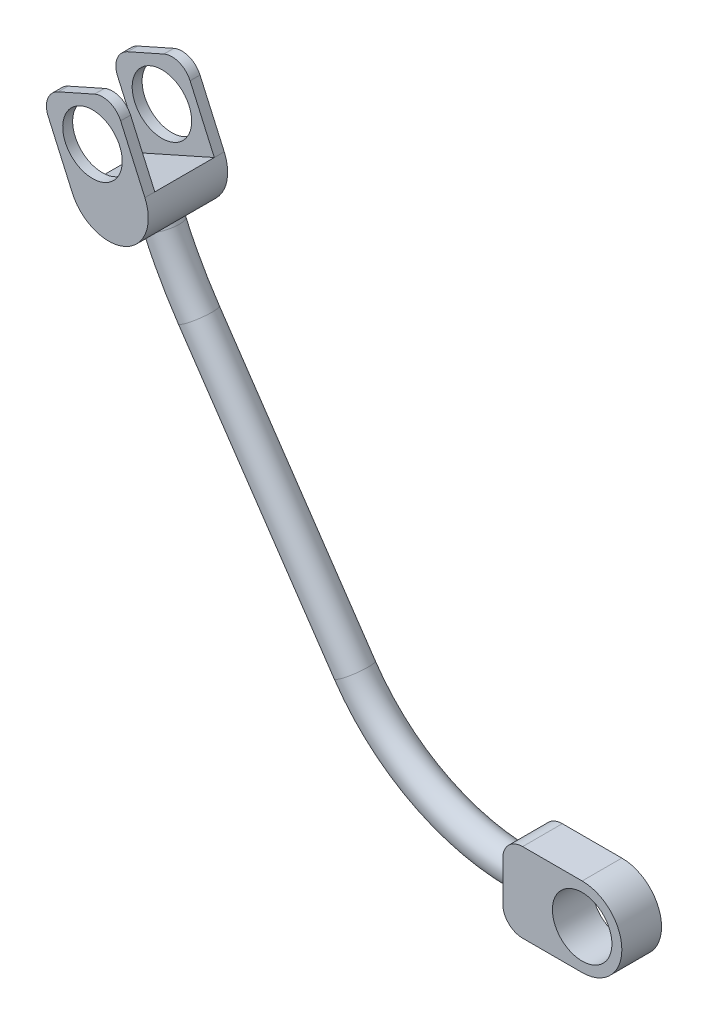
ISO-10303-21;
HEADER;
FILE_DESCRIPTION(('STEP AP214'),'2;1');
FILE_NAME('part.step','',(''),(''),'','','');
FILE_SCHEMA(('AUTOMOTIVE_DESIGN { 1 0 10303 214 1 1 1 1 }'));
ENDSEC;
DATA;
#1=APPLICATION_CONTEXT('core data for automotive mechanical design processes');
#2=APPLICATION_PROTOCOL_DEFINITION('international standard','automotive_design',2000,#1);
#3=PRODUCT_CONTEXT('',#1,'mechanical');
#4=PRODUCT('Part','Part','',(#3));
#5=PRODUCT_RELATED_PRODUCT_CATEGORY('part','',(#4));
#6=PRODUCT_DEFINITION_FORMATION('','',#4);
#7=PRODUCT_DEFINITION_CONTEXT('part definition',#1,'design');
#8=PRODUCT_DEFINITION('design','',#6,#7);
#9=PRODUCT_DEFINITION_SHAPE('','',#8);
#10=(LENGTH_UNIT() NAMED_UNIT(*) SI_UNIT(.MILLI.,.METRE.));
#11=(NAMED_UNIT(*) PLANE_ANGLE_UNIT() SI_UNIT($,.RADIAN.));
#12=(NAMED_UNIT(*) SI_UNIT($,.STERADIAN.) SOLID_ANGLE_UNIT());
#13=UNCERTAINTY_MEASURE_WITH_UNIT(LENGTH_MEASURE(1.E-05),#10,'distance_accuracy_value','');
#14=(GEOMETRIC_REPRESENTATION_CONTEXT(3) GLOBAL_UNCERTAINTY_ASSIGNED_CONTEXT((#13)) GLOBAL_UNIT_ASSIGNED_CONTEXT((#10,
#11,#12)) REPRESENTATION_CONTEXT('',''));
#15=CARTESIAN_POINT('',(0.,0.,0.));
#16=DIRECTION('',(0.,0.,1.));
#17=DIRECTION('',(1.,0.,0.));
#18=AXIS2_PLACEMENT_3D('',#15,#16,#17);
#19=CARTESIAN_POINT('',(-110.264369549458,95.8294636060327,0.));
#20=DIRECTION('',(-0.406736643075799,0.913545457642601,0.));
#21=DIRECTION('',(-0.913545457642601,-0.406736643075799,0.));
#22=AXIS2_PLACEMENT_3D('',#19,#20,#21);
#23=CYLINDRICAL_SURFACE('',#22,4.);
#24=CARTESIAN_POINT('',(-110.264369549459,95.8294636060327,4.00000000000001));
#25=CARTESIAN_POINT('',(-110.362990507074,95.7855370853267,4.00001515276472));
#26=CARTESIAN_POINT('',(-110.462326349155,95.7432409249693,3.99562949503754));
#27=CARTESIAN_POINT('',(-110.661623241283,95.6621358666237,3.97817425046426));
#28=CARTESIAN_POINT('',(-110.761584097444,95.6233259395046,3.9651072359685));
#29=CARTESIAN_POINT('',(-110.961043293078,95.5495203503489,3.93046632499135));
#30=CARTESIAN_POINT('',(-111.060542043311,95.51451206766,3.90892174708062));
#31=CARTESIAN_POINT('',(-111.258623931718,95.4482533171186,3.85756018615502));
#32=CARTESIAN_POINT('',(-111.357207033014,95.4170030000162,3.82774287143961));
#33=CARTESIAN_POINT('',(-111.650310866058,95.3289758228353,3.72631364986528));
#34=CARTESIAN_POINT('',(-111.842508178705,95.2778050578999,3.64266783545964));
#35=CARTESIAN_POINT('',(-112.214750844362,95.1896881131349,3.44607445359489));
#36=CARTESIAN_POINT('',(-112.394787351564,95.1527521978082,3.33310583983869));
#37=CARTESIAN_POINT('',(-112.745043360732,95.0899308532211,3.0755239000453));
#38=CARTESIAN_POINT('',(-112.914522026978,95.0645808934993,2.92977110897774));
#39=CARTESIAN_POINT('',(-113.229718498451,95.0245530373697,2.61318048430075));
#40=CARTESIAN_POINT('',(-113.37542731656,95.0098791702537,2.44233320892421));
#41=CARTESIAN_POINT('',(-113.643899026821,94.9876511924509,2.07114216596097));
#42=CARTESIAN_POINT('',(-113.765349671162,94.9804435820654,1.86982308573622));
#43=CARTESIAN_POINT('',(-113.971132687761,94.970887076529,1.44892280112773));
#44=CARTESIAN_POINT('',(-114.055483419247,94.9685357760552,1.22935069352886));
#45=CARTESIAN_POINT('',(-114.179392429795,94.9658933741943,0.788577585169771));
#46=CARTESIAN_POINT('',(-114.220808737563,94.9655136701321,0.567902129453015));
#47=CARTESIAN_POINT('',(-114.262846210288,94.9651310661673,0.122734664132191));
#48=CARTESIAN_POINT('',(-114.263486592234,94.9651279887664,-0.101755497768421));
#49=CARTESIAN_POINT('',(-114.225377577113,94.965470289453,-0.531515088909115));
#50=CARTESIAN_POINT('',(-114.18936646081,94.9657914312364,-0.73703485948258));
#51=CARTESIAN_POINT('',(-114.084039696666,94.9678490789758,-1.13932254211926));
#52=CARTESIAN_POINT('',(-114.014718803355,94.9695858078818,-1.33608907042836));
#53=CARTESIAN_POINT('',(-113.844303806859,94.9764355447928,-1.7200344571636));
#54=CARTESIAN_POINT('',(-113.742590020484,94.9816167470509,-1.90693562267497));
#55=CARTESIAN_POINT('',(-113.511924070962,94.9979104046763,-2.26283106455256));
#56=CARTESIAN_POINT('',(-113.382961417982,95.0090251467652,-2.43181840701162));
#57=CARTESIAN_POINT('',(-113.091181247359,95.0409984793942,-2.76080536784583));
#58=CARTESIAN_POINT('',(-112.92651823878,95.0625433363924,-2.91910275754984));
#59=CARTESIAN_POINT('',(-112.575721125301,95.1187080553387,-3.20737031862568));
#60=CARTESIAN_POINT('',(-112.389580289149,95.1533320241148,-3.33733157224235));
#61=CARTESIAN_POINT('',(-112.096940322955,95.2173027296596,-3.50925088073896));
#62=CARTESIAN_POINT('',(-111.996035262399,95.2409427102309,-3.563155079602));
#63=CARTESIAN_POINT('',(-111.79104648353,95.2924811385045,-3.66212741897967));
#64=CARTESIAN_POINT('',(-111.686964143176,95.3203777605498,-3.70719932878738));
#65=CARTESIAN_POINT('',(-111.476609340095,95.3805450430087,-3.7880317418878));
#66=CARTESIAN_POINT('',(-111.370339283719,95.4128110947019,-3.82380194174061));
#67=CARTESIAN_POINT('',(-111.15648007709,95.4817555093814,-3.8857063927814));
#68=CARTESIAN_POINT('',(-111.048891504985,95.5184319965419,-3.91184472146079));
#69=CARTESIAN_POINT('',(-110.827938816309,95.5980706982698,-3.95525412759441));
#70=CARTESIAN_POINT('',(-110.714554481982,95.6412552909181,-3.97201744730844));
#71=CARTESIAN_POINT('',(-110.488595686435,95.7320835997381,-3.99439885801446));
#72=CARTESIAN_POINT('',(-110.3760205897,95.7797232791726,-4.00002693807276));
#73=CARTESIAN_POINT('',(-110.264369549459,95.8294636060327,-4.00000000000001));
#74=B_SPLINE_CURVE_WITH_KNOTS('',3,(#24,#25,#26,#27,#28,#29,#30,#31,#32,#33,#34,#35,#36,#37,#38,
#39,#40,#41,#42,#43,#44,#45,#46,#47,#48,#49,#50,#51,#52,#53,#54,#55,#56,#57,#58,#59,#60,#61,#62,
#63,#64,#65,#66,#67,#68,#69,#70,#71,#72,#73),.UNSPECIFIED.,.F.,.F.,(4,2,2,2,2,2,2,2,2,2,2,2,2,2,
2,2,2,2,2,2,2,2,2,2,4),(0.,0.323763399439455,0.64743090814508,0.969988755625815,
1.29255953813415,1.9366716669481,2.58124738867306,3.25317707069423,3.92536021607208,
4.627504425915,5.32930078132312,5.9992674862789,6.66891844518891,7.29196418070528,
7.9151080627593,8.55097179373859,9.18708075677842,9.87231979251034,10.5577741717068,
10.9078494779203,11.2577750580611,11.6073343828352,11.9567455570558,12.3235983530122,
12.690121907611),.UNSPECIFIED.);
#75=CARTESIAN_POINT('',(-110.264369549459,95.8294636060326,4.));
#76=VERTEX_POINT('',#75);
#77=CARTESIAN_POINT('',(-110.264369549459,95.8294636060327,-4.00000000000001));
#78=VERTEX_POINT('',#77);
#79=EDGE_CURVE('E294',#76,#78,#74,.T.);
#80=ORIENTED_EDGE('',*,*,#79,.T.);
#81=CARTESIAN_POINT('',(-110.264369549458,95.8294636060327,0.));
#82=DIRECTION('',(-0.4067366430758,0.913545457642601,0.));
#83=DIRECTION('',(0.,0.,1.));
#84=AXIS2_PLACEMENT_3D('',#81,#82,#83);
#85=CIRCLE('',#84,4.);
#86=EDGE_CURVE('E453',#78,#76,#85,.T.);
#87=ORIENTED_EDGE('',*,*,#86,.T.);
#88=EDGE_LOOP('',(#80,#87));
#89=FACE_BOUND('',#88,.T.);
#90=ADVANCED_FACE('F36',(#89),#23,.T.);
#91=CARTESIAN_POINT('',(0.,0.,5.));
#92=DIRECTION('',(0.,0.,-1.));
#93=DIRECTION('',(-1.,0.,0.));
#94=AXIS2_PLACEMENT_3D('',#91,#92,#93);
#95=CYLINDRICAL_SURFACE('',#94,10.);
#96=DIRECTION('',(0.,0.,-1.));
#97=VECTOR('',#96,1.);
#98=CARTESIAN_POINT('',(0.,10.,5.));
#99=LINE('',#98,#97);
#100=CARTESIAN_POINT('',(0.,10.,5.));
#101=VERTEX_POINT('',#100);
#102=CARTESIAN_POINT('',(0.,10.,-5.));
#103=VERTEX_POINT('',#102);
#104=EDGE_CURVE('E426',#101,#103,#99,.T.);
#105=ORIENTED_EDGE('',*,*,#104,.F.);
#106=CARTESIAN_POINT('',(0.,0.,5.));
#107=DIRECTION('',(0.,0.,-1.));
#108=DIRECTION('',(-1.,0.,0.));
#109=AXIS2_PLACEMENT_3D('',#106,#107,#108);
#110=CIRCLE('',#109,10.);
#111=CARTESIAN_POINT('',(0.,-10.,5.));
#112=VERTEX_POINT('',#111);
#113=EDGE_CURVE('E421',#112,#101,#110,.F.);
#114=ORIENTED_EDGE('',*,*,#113,.F.);
#115=DIRECTION('',(0.,0.,-1.));
#116=VECTOR('',#115,1.);
#117=CARTESIAN_POINT('',(0.,-10.,5.));
#118=LINE('',#117,#116);
#119=CARTESIAN_POINT('',(0.,-10.,-5.));
#120=VERTEX_POINT('',#119);
#121=EDGE_CURVE('E423',#120,#112,#118,.F.);
#122=ORIENTED_EDGE('',*,*,#121,.F.);
#123=CARTESIAN_POINT('',(0.,0.,-5.));
#124=DIRECTION('',(0.,0.,-1.));
#125=DIRECTION('',(-1.,0.,0.));
#126=AXIS2_PLACEMENT_3D('',#123,#124,#125);
#127=CIRCLE('',#126,10.);
#128=EDGE_CURVE('E418',#103,#120,#127,.T.);
#129=ORIENTED_EDGE('',*,*,#128,.F.);
#130=EDGE_LOOP('',(#105,#114,#122,#129));
#131=FACE_BOUND('',#130,.T.);
#132=ADVANCED_FACE('F371',(#131),#95,.T.);
#133=CARTESIAN_POINT('',(-20.,10.,5.));
#134=DIRECTION('',(0.,-1.,0.));
#135=DIRECTION('',(0.,0.,-1.));
#136=AXIS2_PLACEMENT_3D('',#133,#134,#135);
#137=PLANE('',#136);
#138=DIRECTION('',(-1.,0.,0.));
#139=VECTOR('',#138,1.);
#140=CARTESIAN_POINT('',(-20.,10.,-5.));
#141=LINE('',#140,#139);
#142=CARTESIAN_POINT('',(-15.,10.,-5.));
#143=VERTEX_POINT('',#142);
#144=EDGE_CURVE('E436',#103,#143,#141,.T.);
#145=ORIENTED_EDGE('',*,*,#144,.T.);
#146=DIRECTION('',(0.,0.,-1.));
#147=VECTOR('',#146,1.);
#148=CARTESIAN_POINT('',(-15.,10.,5.));
#149=LINE('',#148,#147);
#150=CARTESIAN_POINT('',(-15.,10.,5.));
#151=VERTEX_POINT('',#150);
#152=EDGE_CURVE('E11',#143,#151,#149,.F.);
#153=ORIENTED_EDGE('',*,*,#152,.T.);
#154=DIRECTION('',(-1.,0.,0.));
#155=VECTOR('',#154,1.);
#156=CARTESIAN_POINT('',(-20.,10.,5.));
#157=LINE('',#156,#155);
#158=EDGE_CURVE('E432',#101,#151,#157,.T.);
#159=ORIENTED_EDGE('',*,*,#158,.F.);
#160=ORIENTED_EDGE('',*,*,#104,.T.);
#161=EDGE_LOOP('',(#145,#153,#159,#160));
#162=FACE_BOUND('',#161,.T.);
#163=ADVANCED_FACE('F378',(#162),#137,.F.);
#164=CARTESIAN_POINT('',(-20.,-10.,5.));
#165=DIRECTION('',(1.,0.,0.));
#166=DIRECTION('',(0.,0.,-1.));
#167=AXIS2_PLACEMENT_3D('',#164,#165,#166);
#168=PLANE('',#167);
#169=CARTESIAN_POINT('',(-20.,0.,0.));
#170=DIRECTION('',(-1.,0.,0.));
#171=DIRECTION('',(0.,0.,1.));
#172=AXIS2_PLACEMENT_3D('',#169,#170,#171);
#173=CIRCLE('',#172,4.);
#174=CARTESIAN_POINT('',(-20.,-4.,0.));
#175=VERTEX_POINT('',#174);
#176=EDGE_CURVE('E446',#175,#175,#173,.T.);
#177=ORIENTED_EDGE('',*,*,#176,.F.);
#178=EDGE_LOOP('',(#177));
#179=FACE_BOUND('',#178,.T.);
#180=DIRECTION('',(0.,-1.,0.));
#181=VECTOR('',#180,1.);
#182=CARTESIAN_POINT('',(-20.,-10.,-5.));
#183=LINE('',#182,#181);
#184=CARTESIAN_POINT('',(-20.,5.,-5.));
#185=VERTEX_POINT('',#184);
#186=CARTESIAN_POINT('',(-20.,-5.,-5.));
#187=VERTEX_POINT('',#186);
#188=EDGE_CURVE('E433',#185,#187,#183,.T.);
#189=ORIENTED_EDGE('',*,*,#188,.T.);
#190=DIRECTION('',(0.,0.,-1.));
#191=VECTOR('',#190,1.);
#192=CARTESIAN_POINT('',(-20.,-5.,5.));
#193=LINE('',#192,#191);
#194=CARTESIAN_POINT('',(-20.,-5.,5.));
#195=VERTEX_POINT('',#194);
#196=EDGE_CURVE('E406',#187,#195,#193,.F.);
#197=ORIENTED_EDGE('',*,*,#196,.T.);
#198=DIRECTION('',(0.,-1.,0.));
#199=VECTOR('',#198,1.);
#200=CARTESIAN_POINT('',(-20.,-10.,5.));
#201=LINE('',#200,#199);
#202=CARTESIAN_POINT('',(-20.,5.,5.));
#203=VERTEX_POINT('',#202);
#204=EDGE_CURVE('E440',#203,#195,#201,.T.);
#205=ORIENTED_EDGE('',*,*,#204,.F.);
#206=DIRECTION('',(0.,0.,-1.));
#207=VECTOR('',#206,1.);
#208=CARTESIAN_POINT('',(-20.,5.,5.));
#209=LINE('',#208,#207);
#210=EDGE_CURVE('E402',#203,#185,#209,.T.);
#211=ORIENTED_EDGE('',*,*,#210,.T.);
#212=EDGE_LOOP('',(#189,#197,#205,#211));
#213=FACE_BOUND('',#212,.T.);
#214=ADVANCED_FACE('F531',(#179,#213),#168,.F.);
#215=CARTESIAN_POINT('',(-20.,-10.,5.));
#216=DIRECTION('',(0.,1.,0.));
#217=DIRECTION('',(0.,0.,1.));
#218=AXIS2_PLACEMENT_3D('',#215,#216,#217);
#219=PLANE('',#218);
#220=DIRECTION('',(1.,0.,0.));
#221=VECTOR('',#220,1.);
#222=CARTESIAN_POINT('',(-20.,-10.,5.));
#223=LINE('',#222,#221);
#224=CARTESIAN_POINT('',(-15.,-10.,5.));
#225=VERTEX_POINT('',#224);
#226=EDGE_CURVE('E429',#225,#112,#223,.T.);
#227=ORIENTED_EDGE('',*,*,#226,.F.);
#228=DIRECTION('',(0.,0.,-1.));
#229=VECTOR('',#228,1.);
#230=CARTESIAN_POINT('',(-15.,-10.,5.));
#231=LINE('',#230,#229);
#232=CARTESIAN_POINT('',(-15.,-10.,-5.));
#233=VERTEX_POINT('',#232);
#234=EDGE_CURVE('E415',#225,#233,#231,.T.);
#235=ORIENTED_EDGE('',*,*,#234,.T.);
#236=DIRECTION('',(1.,0.,0.));
#237=VECTOR('',#236,1.);
#238=CARTESIAN_POINT('',(-20.,-10.,-5.));
#239=LINE('',#238,#237);
#240=EDGE_CURVE('E430',#233,#120,#239,.T.);
#241=ORIENTED_EDGE('',*,*,#240,.T.);
#242=ORIENTED_EDGE('',*,*,#121,.T.);
#243=EDGE_LOOP('',(#227,#235,#241,#242));
#244=FACE_BOUND('',#243,.T.);
#245=ADVANCED_FACE('F534',(#244),#219,.F.);
#246=CARTESIAN_POINT('',(0.,0.,5.));
#247=DIRECTION('',(0.,0.,-1.));
#248=DIRECTION('',(-1.,0.,0.));
#249=AXIS2_PLACEMENT_3D('',#246,#247,#248);
#250=PLANE('',#249);
#251=CARTESIAN_POINT('',(0.,0.,5.));
#252=DIRECTION('',(0.,0.,1.));
#253=DIRECTION('',(1.,0.,0.));
#254=AXIS2_PLACEMENT_3D('',#251,#252,#253);
#255=CIRCLE('',#254,7.5);
#256=CARTESIAN_POINT('',(7.5,0.,5.));
#257=VERTEX_POINT('',#256);
#258=EDGE_CURVE('E443',#257,#257,#255,.T.);
#259=ORIENTED_EDGE('',*,*,#258,.F.);
#260=EDGE_LOOP('',(#259));
#261=FACE_BOUND('',#260,.T.);
#262=ORIENTED_EDGE('',*,*,#204,.T.);
#263=CARTESIAN_POINT('',(-15.,-5.,5.));
#264=DIRECTION('',(0.,0.,-1.));
#265=DIRECTION('',(-1.,0.,0.));
#266=AXIS2_PLACEMENT_3D('',#263,#264,#265);
#267=CIRCLE('',#266,5.);
#268=EDGE_CURVE('E44',#195,#225,#267,.F.);
#269=ORIENTED_EDGE('',*,*,#268,.T.);
#270=ORIENTED_EDGE('',*,*,#226,.T.);
#271=ORIENTED_EDGE('',*,*,#113,.T.);
#272=ORIENTED_EDGE('',*,*,#158,.T.);
#273=CARTESIAN_POINT('',(-15.,5.,5.));
#274=DIRECTION('',(0.,0.,-1.));
#275=DIRECTION('',(-1.,0.,0.));
#276=AXIS2_PLACEMENT_3D('',#273,#274,#275);
#277=CIRCLE('',#276,5.);
#278=EDGE_CURVE('E400',#151,#203,#277,.F.);
#279=ORIENTED_EDGE('',*,*,#278,.T.);
#280=EDGE_LOOP('',(#262,#269,#270,#271,#272,#279));
#281=FACE_BOUND('',#280,.T.);
#282=ADVANCED_FACE('F542',(#261,#281),#250,.F.);
#283=CARTESIAN_POINT('',(0.,0.,-5.));
#284=DIRECTION('',(0.,0.,-1.));
#285=DIRECTION('',(-1.,0.,0.));
#286=AXIS2_PLACEMENT_3D('',#283,#284,#285);
#287=PLANE('',#286);
#288=CARTESIAN_POINT('',(0.,0.,-5.));
#289=DIRECTION('',(0.,0.,1.));
#290=DIRECTION('',(1.,0.,0.));
#291=AXIS2_PLACEMENT_3D('',#288,#289,#290);
#292=CIRCLE('',#291,7.5);
#293=CARTESIAN_POINT('',(7.5,0.,-5.));
#294=VERTEX_POINT('',#293);
#295=EDGE_CURVE('E438',#294,#294,#292,.T.);
#296=ORIENTED_EDGE('',*,*,#295,.T.);
#297=EDGE_LOOP('',(#296));
#298=FACE_BOUND('',#297,.T.);
#299=ORIENTED_EDGE('',*,*,#240,.F.);
#300=CARTESIAN_POINT('',(-15.,-5.,-5.));
#301=DIRECTION('',(0.,0.,-1.));
#302=DIRECTION('',(-1.,0.,0.));
#303=AXIS2_PLACEMENT_3D('',#300,#301,#302);
#304=CIRCLE('',#303,5.);
#305=EDGE_CURVE('E411',#233,#187,#304,.T.);
#306=ORIENTED_EDGE('',*,*,#305,.T.);
#307=ORIENTED_EDGE('',*,*,#188,.F.);
#308=CARTESIAN_POINT('',(-15.,5.,-5.));
#309=DIRECTION('',(0.,0.,-1.));
#310=DIRECTION('',(-1.,0.,0.));
#311=AXIS2_PLACEMENT_3D('',#308,#309,#310);
#312=CIRCLE('',#311,5.);
#313=EDGE_CURVE('E413',#185,#143,#312,.T.);
#314=ORIENTED_EDGE('',*,*,#313,.T.);
#315=ORIENTED_EDGE('',*,*,#144,.F.);
#316=ORIENTED_EDGE('',*,*,#128,.T.);
#317=EDGE_LOOP('',(#299,#306,#307,#314,#315,#316));
#318=FACE_BOUND('',#317,.T.);
#319=ADVANCED_FACE('F549',(#298,#318),#287,.T.);
#320=CARTESIAN_POINT('',(0.,0.,-5.));
#321=DIRECTION('',(0.,0.,1.));
#322=DIRECTION('',(1.,0.,0.));
#323=AXIS2_PLACEMENT_3D('',#320,#321,#322);
#324=CYLINDRICAL_SURFACE('',#323,7.5);
#325=ORIENTED_EDGE('',*,*,#295,.F.);
#326=EDGE_LOOP('',(#325));
#327=FACE_BOUND('',#326,.T.);
#328=ORIENTED_EDGE('',*,*,#258,.T.);
#329=EDGE_LOOP('',(#328));
#330=FACE_BOUND('',#329,.T.);
#331=ADVANCED_FACE('F396',(#327,#330),#324,.F.);
#332=CARTESIAN_POINT('',(-15.,-5.,5.));
#333=DIRECTION('',(0.,0.,-1.));
#334=DIRECTION('',(-1.,0.,0.));
#335=AXIS2_PLACEMENT_3D('',#332,#333,#334);
#336=CYLINDRICAL_SURFACE('',#335,5.);
#337=ORIENTED_EDGE('',*,*,#268,.F.);
#338=ORIENTED_EDGE('',*,*,#196,.F.);
#339=ORIENTED_EDGE('',*,*,#305,.F.);
#340=ORIENTED_EDGE('',*,*,#234,.F.);
#341=EDGE_LOOP('',(#337,#338,#339,#340));
#342=FACE_BOUND('',#341,.T.);
#343=ADVANCED_FACE('F391',(#342),#336,.T.);
#344=CARTESIAN_POINT('',(-15.,5.,5.));
#345=DIRECTION('',(0.,0.,-1.));
#346=DIRECTION('',(-1.,0.,0.));
#347=AXIS2_PLACEMENT_3D('',#344,#345,#346);
#348=CYLINDRICAL_SURFACE('',#347,5.);
#349=ORIENTED_EDGE('',*,*,#278,.F.);
#350=ORIENTED_EDGE('',*,*,#152,.F.);
#351=ORIENTED_EDGE('',*,*,#313,.F.);
#352=ORIENTED_EDGE('',*,*,#210,.F.);
#353=EDGE_LOOP('',(#349,#350,#351,#352));
#354=FACE_BOUND('',#353,.T.);
#355=ADVANCED_FACE('F38',(#354),#348,.T.);
#356=CARTESIAN_POINT('',(-110.264369549459,95.8294636060327,-4.00000000000001));
#357=CARTESIAN_POINT('',(-110.165735481726,95.873360680933,-4.00001515276472));
#358=CARTESIAN_POINT('',(-110.067834656773,95.9188799425336,-3.99562949503754));
#359=CARTESIAN_POINT('',(-109.874206202069,96.0127165197823,-3.97817425046426));
#360=CARTESIAN_POINT('',(-109.778477937258,96.0610330027228,-3.9651072359685));
#361=CARTESIAN_POINT('',(-109.590165443067,96.1598744932278,-3.93046632499135));
#362=CARTESIAN_POINT('',(-109.497571559863,96.2103913611817,-3.90892174708062));
#363=CARTESIAN_POINT('',(-109.315789058157,96.3132591336454,-3.85756018615502));
#364=CARTESIAN_POINT('',(-109.226600576361,96.3656101116215,-3.8277428714396));
#365=CARTESIAN_POINT('',(-108.965058889607,96.5245270300328,-3.72631364986528));
#366=CARTESIAN_POINT('',(-108.798426496077,96.6331175434282,-3.64266783545965));
#367=CARTESIAN_POINT('',(-108.483863883955,96.8507860095519,-3.4460744535949));
#368=CARTESIAN_POINT('',(-108.335947212375,96.9598642568568,-3.33310583983869));
#369=CARTESIAN_POINT('',(-108.05489483942,97.1781195132667,-3.0755239000453));
#370=CARTESIAN_POINT('',(-107.922652785316,97.2871042731964,-2.92977110897774));
#371=CARTESIAN_POINT('',(-107.68199868508,97.4945570363372,-2.61318048430075));
#372=CARTESIAN_POINT('',(-107.57359564685,97.5930210569402,-2.44233320892422));
#373=CARTESIAN_POINT('',(-107.377434401887,97.7776609989427,-2.07114216596097));
#374=CARTESIAN_POINT('',(-107.290811760235,97.8630935841277,-1.86982308573622));
#375=CARTESIAN_POINT('',(-107.146014177921,98.0096256177399,-1.44892280112773));
#376=CARTESIAN_POINT('',(-107.087825165035,98.0707371002572,-1.22935069352887));
#377=CARTESIAN_POINT('',(-107.002950166403,98.1610513283169,-0.788577585169777));
#378=CARTESIAN_POINT('',(-106.974955072164,98.1915755715154,-0.567902129453021));
#379=CARTESIAN_POINT('',(-106.946542182393,98.2225594898245,-0.122734664132199));
#380=CARTESIAN_POINT('',(-106.946111396279,98.2230333271706,0.101755497768412));
#381=CARTESIAN_POINT('',(-106.971865683658,98.1949418536457,0.531515088909104));
#382=CARTESIAN_POINT('',(-106.9962004786,98.1683952647019,0.737034859482571));
#383=CARTESIAN_POINT('',(-107.068206970428,98.0914990600234,1.13932254211925));
#384=CARTESIAN_POINT('',(-107.115882342903,98.0411456953277,1.33608907042836));
#385=CARTESIAN_POINT('',(-107.235002579382,97.9190860411104,1.7200344571636));
#386=CARTESIAN_POINT('',(-107.306912770582,97.8469648680952,1.90693562267496));
#387=CARTESIAN_POINT('',(-107.473366964604,97.6864492463002,2.26283106455254));
#388=CARTESIAN_POINT('',(-107.56791968586,97.598048532172,2.43181840701161));
#389=CARTESIAN_POINT('',(-107.786919545049,97.4026079436462,2.76080536784583));
#390=CARTESIAN_POINT('',(-107.913111552818,97.2946558041003,2.91910275754984));
#391=CARTESIAN_POINT('',(-108.189579158329,97.0715442768705,3.20737031862568));
#392=CARTESIAN_POINT('',(-108.339862312125,96.9563826348956,3.33733157224236));
#393=CARTESIAN_POINT('',(-108.583216168957,96.7817135152812,3.50925088073896));
#394=CARTESIAN_POINT('',(-108.668302762547,96.7225446761987,3.563155079602));
#395=CARTESIAN_POINT('',(-108.843767544733,96.6046942656624,3.66212741897966));
#396=CARTESIAN_POINT('',(-108.934143454567,96.5460124966293,3.70719932878737));
#397=CARTESIAN_POINT('',(-109.119611296125,96.4299481834001,3.7880317418878));
#398=CARTESIAN_POINT('',(-109.214698192741,96.3725643436354,3.82380194174061));
#399=CARTESIAN_POINT('',(-109.409033618362,96.2597687988479,3.8857063927814));
#400=CARTESIAN_POINT('',(-109.508280366502,96.2043562683005,3.9118447214608));
#401=CARTESIAN_POINT('',(-109.71530966215,96.0934451138119,3.95525412759441));
#402=CARTESIAN_POINT('',(-109.823270997097,96.0380802651306,3.97201744730844));
#403=CARTESIAN_POINT('',(-110.041965530679,95.9309361568042,3.99439885801445));
#404=CARTESIAN_POINT('',(-110.152696154677,95.8791537237753,4.00002693807276));
#405=CARTESIAN_POINT('',(-110.264369549459,95.8294636060327,4.00000000000001));
#406=B_SPLINE_CURVE_WITH_KNOTS('',3,(#356,#357,#358,#359,#360,#361,#362,#363,#364,#365,#366,
#367,#368,#369,#370,#371,#372,#373,#374,#375,#376,#377,#378,#379,#380,#381,#382,#383,#384,#385,
#386,#387,#388,#389,#390,#391,#392,#393,#394,#395,#396,#397,#398,#399,#400,#401,#402,#403,#404,
#405),.UNSPECIFIED.,.F.,.F.,(4,2,2,2,2,2,2,2,2,2,2,2,2,2,2,2,2,2,2,2,2,2,2,2,4),(0.,
0.323763399439447,0.647430908145065,0.96998875562579,1.29255953813412,1.93667166694806,
2.58124738867303,3.25317707069421,3.92536021607205,4.62750442591497,5.32930078132309,
5.99926748627886,6.66891844518887,7.29196418070525,7.91510806275927,8.55097179373855,
9.18708075677839,9.87231979251031,10.5577741717067,10.9078494779202,11.257775058061,
11.6073343828351,11.9567455570557,12.3235983530121,12.690121907611),.UNSPECIFIED.);
#407=EDGE_CURVE('E50',#78,#76,#406,.T.);
#408=ORIENTED_EDGE('',*,*,#407,.T.);
#409=EDGE_CURVE('E451',#76,#78,#85,.T.);
#410=ORIENTED_EDGE('',*,*,#409,.T.);
#411=EDGE_LOOP('',(#408,#410));
#412=FACE_BOUND('',#411,.T.);
#413=ADVANCED_FACE('F374',(#412),#23,.T.);
#414=CARTESIAN_POINT('',(-18.4680858332064,136.699802321229,0.));
#415=DIRECTION('',(0.,0.,-1.));
#416=DIRECTION('',(-1.,0.,0.));
#417=AXIS2_PLACEMENT_3D('',#414,#415,#416);
#418=TOROIDAL_SURFACE('',#417,100.483542387843,4.);
#419=CARTESIAN_POINT('',(-101.587122571258,80.2359375708601,0.));
#420=DIRECTION('',(-0.561921518774003,0.8271905504409,0.));
#421=DIRECTION('',(0.,0.,1.));
#422=AXIS2_PLACEMENT_3D('',#419,#420,#421);
#423=CIRCLE('',#422,4.);
#424=CARTESIAN_POINT('',(-101.587122571258,80.2359375708601,4.));
#425=VERTEX_POINT('',#424);
#426=EDGE_CURVE('E454',#425,#425,#423,.T.);
#427=ORIENTED_EDGE('',*,*,#426,.T.);
#428=EDGE_LOOP('',(#427));
#429=FACE_BOUND('',#428,.T.);
#430=ORIENTED_EDGE('',*,*,#409,.F.);
#431=ORIENTED_EDGE('',*,*,#86,.F.);
#432=EDGE_LOOP('',(#430,#431));
#433=FACE_BOUND('',#432,.T.);
#434=ADVANCED_FACE('F384',(#429,#433),#418,.T.);
#435=CARTESIAN_POINT('',(-62.2996233011042,22.4017969285343,0.));
#436=DIRECTION('',(-0.561921518774002,0.8271905504409,0.));
#437=DIRECTION('',(-0.8271905504409,-0.561921518774002,0.));
#438=AXIS2_PLACEMENT_3D('',#435,#436,#437);
#439=CYLINDRICAL_SURFACE('',#438,4.);
#440=CARTESIAN_POINT('',(-62.2996233011042,22.4017969285343,0.));
#441=DIRECTION('',(-0.561921518774003,0.8271905504409,0.));
#442=DIRECTION('',(0.,0.,1.));
#443=AXIS2_PLACEMENT_3D('',#440,#441,#442);
#444=CIRCLE('',#443,4.);
#445=CARTESIAN_POINT('',(-65.6083855028678,20.1541108534383,0.));
#446=VERTEX_POINT('',#445);
#447=EDGE_CURVE('E457',#446,#446,#444,.T.);
#448=ORIENTED_EDGE('',*,*,#447,.T.);
#449=EDGE_LOOP('',(#448));
#450=FACE_BOUND('',#449,.T.);
#451=ORIENTED_EDGE('',*,*,#426,.F.);
#452=EDGE_LOOP('',(#451));
#453=FACE_BOUND('',#452,.T.);
#454=ADVANCED_FACE('F389',(#450,#453),#439,.T.);
#455=CARTESIAN_POINT('',(-20.,51.1364924062034,0.));
#456=DIRECTION('',(0.,0.,-1.));
#457=DIRECTION('',(-1.,0.,0.));
#458=AXIS2_PLACEMENT_3D('',#455,#456,#457);
#459=TOROIDAL_SURFACE('',#458,51.1364924062034,4.);
#460=CARTESIAN_POINT('',(-20.,51.1364924062034,0.));
#461=DIRECTION('',(0.,0.,-1.));
#462=DIRECTION('',(-1.,0.,0.));
#463=AXIS2_PLACEMENT_3D('',#460,#461,#462);
#464=CIRCLE('',#463,55.1364924062034);
#465=EDGE_CURVE('',#175,#446,#464,.T.);
#466=ORIENTED_EDGE('',*,*,#176,.T.);
#467=ORIENTED_EDGE('',*,*,#447,.F.);
#468=ORIENTED_EDGE('',*,*,#465,.T.);
#469=ORIENTED_EDGE('',*,*,#465,.F.);
#470=EDGE_LOOP('',(#466,#468,#467,#469));
#471=FACE_BOUND('',#470,.T.);
#472=ADVANCED_FACE('F512',(#471),#459,.T.);
#473=CARTESIAN_POINT('',(-119.399824125885,91.7620971752747,10.));
#474=DIRECTION('',(0.913545457642601,0.406736643075801,0.));
#475=DIRECTION('',(-0.406736643075801,0.913545457642601,0.));
#476=AXIS2_PLACEMENT_3D('',#473,#474,#475);
#477=PLANE('',#476);
#478=DIRECTION('',(0.406736643075801,-0.913545457642601,0.));
#479=VECTOR('',#478,1.);
#480=CARTESIAN_POINT('',(-119.399824125885,91.7620971752747,-10.));
#481=LINE('',#480,#479);
#482=CARTESIAN_POINT('',(-129.56824020278,114.60073361634,-10.));
#483=VERTEX_POINT('',#482);
#484=CARTESIAN_POINT('',(-123.467190556643,100.897551751701,-10.));
#485=VERTEX_POINT('',#484);
#486=EDGE_CURVE('E232',#483,#485,#481,.T.);
#487=ORIENTED_EDGE('',*,*,#486,.T.);
#488=DIRECTION('',(0.,0.,-1.));
#489=VECTOR('',#488,1.);
#490=CARTESIAN_POINT('',(-123.467190556643,100.897551751701,10.));
#491=LINE('',#490,#489);
#492=CARTESIAN_POINT('',(-123.467190556643,100.897551751701,-7.5));
#493=VERTEX_POINT('',#492);
#494=EDGE_CURVE('E460',#485,#493,#491,.F.);
#495=ORIENTED_EDGE('',*,*,#494,.T.);
#496=DIRECTION('',(-0.406736643075801,0.913545457642601,0.));
#497=VECTOR('',#496,1.);
#498=CARTESIAN_POINT('',(-119.399824125885,91.7620971752747,-7.5));
#499=LINE('',#498,#497);
#500=CARTESIAN_POINT('',(-129.56824020278,114.60073361634,-7.5));
#501=VERTEX_POINT('',#500);
#502=EDGE_CURVE('E220',#493,#501,#499,.T.);
#503=ORIENTED_EDGE('',*,*,#502,.T.);
#504=DIRECTION('',(0.,0.,-1.));
#505=VECTOR('',#504,1.);
#506=CARTESIAN_POINT('',(-129.56824020278,114.60073361634,10.));
#507=LINE('',#506,#505);
#508=EDGE_CURVE('E275',#501,#483,#507,.T.);
#509=ORIENTED_EDGE('',*,*,#508,.T.);
#510=EDGE_LOOP('',(#487,#495,#503,#509));
#511=FACE_BOUND('',#510,.T.);
#512=ADVANCED_FACE('F349',(#511),#477,.F.);
#513=CARTESIAN_POINT('',(-101.128914973033,99.8968300367907,10.));
#514=DIRECTION('',(-0.913545457642601,-0.4067366430758,0.));
#515=DIRECTION('',(0.4067366430758,-0.913545457642601,0.));
#516=AXIS2_PLACEMENT_3D('',#513,#514,#515);
#517=PLANE('',#516);
#518=DIRECTION('',(-0.4067366430758,0.913545457642601,0.));
#519=VECTOR('',#518,1.);
#520=CARTESIAN_POINT('',(-101.128914973033,99.8968300367907,10.));
#521=LINE('',#520,#519);
#522=CARTESIAN_POINT('',(-105.196281403791,109.032284613217,10.));
#523=VERTEX_POINT('',#522);
#524=CARTESIAN_POINT('',(-111.297331049928,122.735466477856,10.));
#525=VERTEX_POINT('',#524);
#526=EDGE_CURVE('E195',#523,#525,#521,.T.);
#527=ORIENTED_EDGE('',*,*,#526,.F.);
#528=DIRECTION('',(0.,0.,-1.));
#529=VECTOR('',#528,1.);
#530=CARTESIAN_POINT('',(-105.196281403791,109.032284613217,10.));
#531=LINE('',#530,#529);
#532=CARTESIAN_POINT('',(-105.196281403791,109.032284613217,7.5));
#533=VERTEX_POINT('',#532);
#534=EDGE_CURVE('E178',#523,#533,#531,.T.);
#535=ORIENTED_EDGE('',*,*,#534,.T.);
#536=DIRECTION('',(0.406736643075799,-0.913545457642601,0.));
#537=VECTOR('',#536,1.);
#538=CARTESIAN_POINT('',(-113.331014265307,127.303193766069,7.5));
#539=LINE('',#538,#537);
#540=CARTESIAN_POINT('',(-111.297331049928,122.735466477856,7.5));
#541=VERTEX_POINT('',#540);
#542=EDGE_CURVE('E186',#541,#533,#539,.T.);
#543=ORIENTED_EDGE('',*,*,#542,.F.);
#544=DIRECTION('',(0.,0.,-1.));
#545=VECTOR('',#544,1.);
#546=CARTESIAN_POINT('',(-111.297331049928,122.735466477856,10.));
#547=LINE('',#546,#545);
#548=EDGE_CURVE('E264',#541,#525,#547,.F.);
#549=ORIENTED_EDGE('',*,*,#548,.T.);
#550=EDGE_LOOP('',(#527,#535,#543,#549));
#551=FACE_BOUND('',#550,.T.);
#552=ADVANCED_FACE('F192',(#551),#517,.F.);
#553=CARTESIAN_POINT('',(-131.601923418159,119.168460904553,10.));
#554=DIRECTION('',(0.4067366430758,-0.913545457642601,0.));
#555=DIRECTION('',(0.913545457642601,0.4067366430758,0.));
#556=AXIS2_PLACEMENT_3D('',#553,#554,#555);
#557=PLANE('',#556);
#558=DIRECTION('',(0.913545457642601,0.4067366430758,0.));
#559=VECTOR('',#558,1.);
#560=CARTESIAN_POINT('',(-179.597360086207,97.7995157360283,7.5));
#561=LINE('',#560,#559);
#562=CARTESIAN_POINT('',(-127.034196129946,121.202144119932,7.5));
#563=VERTEX_POINT('',#562);
#564=CARTESIAN_POINT('',(-117.89874155352,125.26951055069,7.5));
#565=VERTEX_POINT('',#564);
#566=EDGE_CURVE('E252',#563,#565,#561,.T.);
#567=ORIENTED_EDGE('',*,*,#566,.F.);
#568=DIRECTION('',(0.,0.,-1.));
#569=VECTOR('',#568,1.);
#570=CARTESIAN_POINT('',(-127.034196129946,121.202144119932,10.));
#571=LINE('',#570,#569);
#572=CARTESIAN_POINT('',(-127.034196129946,121.202144119932,10.));
#573=VERTEX_POINT('',#572);
#574=EDGE_CURVE('E284',#563,#573,#571,.F.);
#575=ORIENTED_EDGE('',*,*,#574,.T.);
#576=DIRECTION('',(-0.913545457642601,-0.4067366430758,0.));
#577=VECTOR('',#576,1.);
#578=CARTESIAN_POINT('',(-131.601923418159,119.168460904553,10.));
#579=LINE('',#578,#577);
#580=CARTESIAN_POINT('',(-117.89874155352,125.26951055069,10.));
#581=VERTEX_POINT('',#580);
#582=EDGE_CURVE('E240',#581,#573,#579,.T.);
#583=ORIENTED_EDGE('',*,*,#582,.F.);
#584=DIRECTION('',(0.,0.,-1.));
#585=VECTOR('',#584,1.);
#586=CARTESIAN_POINT('',(-117.89874155352,125.26951055069,10.));
#587=LINE('',#586,#585);
#588=EDGE_CURVE('E281',#581,#565,#587,.T.);
#589=ORIENTED_EDGE('',*,*,#588,.T.);
#590=EDGE_LOOP('',(#567,#575,#583,#589));
#591=FACE_BOUND('',#590,.T.);
#592=ADVANCED_FACE('F342',(#591),#557,.F.);
#593=CARTESIAN_POINT('',(-118.399102410975,114.100372758885,10.));
#594=DIRECTION('',(0.,0.,-1.));
#595=DIRECTION('',(-1.,0.,0.));
#596=AXIS2_PLACEMENT_3D('',#593,#594,#595);
#597=CYLINDRICAL_SURFACE('',#596,7.50000000000001);
#598=CARTESIAN_POINT('',(-118.399102410975,114.100372758885,7.5));
#599=DIRECTION('',(0.,0.,1.));
#600=DIRECTION('',(0.,-1.,0.));
#601=AXIS2_PLACEMENT_3D('',#598,#599,#600);
#602=CIRCLE('',#601,7.50000000000001);
#603=CARTESIAN_POINT('',(-118.399102410975,106.600372758885,7.5));
#604=VERTEX_POINT('',#603);
#605=EDGE_CURVE('E223',#604,#604,#602,.T.);
#606=ORIENTED_EDGE('',*,*,#605,.F.);
#607=EDGE_LOOP('',(#606));
#608=FACE_BOUND('',#607,.T.);
#609=CARTESIAN_POINT('',(-118.399102410975,114.100372758885,10.));
#610=DIRECTION('',(0.,0.,1.));
#611=DIRECTION('',(1.,0.,0.));
#612=AXIS2_PLACEMENT_3D('',#609,#610,#611);
#613=CIRCLE('',#612,7.50000000000001);
#614=CARTESIAN_POINT('',(-110.899102410974,114.100372758885,10.));
#615=VERTEX_POINT('',#614);
#616=EDGE_CURVE('E229',#615,#615,#613,.T.);
#617=ORIENTED_EDGE('',*,*,#616,.T.);
#618=EDGE_LOOP('',(#617));
#619=FACE_BOUND('',#618,.T.);
#620=ADVANCED_FACE('F328',(#608,#619),#597,.F.);
#621=CARTESIAN_POINT('',(0.,0.,10.));
#622=DIRECTION('',(0.,0.,-1.));
#623=DIRECTION('',(-1.,0.,0.));
#624=AXIS2_PLACEMENT_3D('',#621,#622,#623);
#625=PLANE('',#624);
#626=CARTESIAN_POINT('',(-114.331735980217,104.964918182459,10.));
#627=DIRECTION('',(0.,0.,-1.));
#628=DIRECTION('',(-1.,0.,0.));
#629=AXIS2_PLACEMENT_3D('',#626,#627,#628);
#630=CIRCLE('',#629,10.);
#631=CARTESIAN_POINT('',(-123.467190556643,100.897551751701,10.));
#632=VERTEX_POINT('',#631);
#633=CARTESIAN_POINT('',(-110.264369549459,95.8294636060327,10.));
#634=VERTEX_POINT('',#633);
#635=EDGE_CURVE('E470',#632,#634,#630,.F.);
#636=ORIENTED_EDGE('',*,*,#635,.T.);
#637=CARTESIAN_POINT('',(-114.331735980217,104.964918182459,10.));
#638=DIRECTION('',(0.,0.,-1.));
#639=DIRECTION('',(-1.,0.,0.));
#640=AXIS2_PLACEMENT_3D('',#637,#638,#639);
#641=CIRCLE('',#640,10.);
#642=EDGE_CURVE('E469',#634,#523,#641,.F.);
#643=ORIENTED_EDGE('',*,*,#642,.T.);
#644=ORIENTED_EDGE('',*,*,#526,.T.);
#645=CARTESIAN_POINT('',(-115.865058338141,120.701783262477,10.));
#646=DIRECTION('',(0.,0.,-1.));
#647=DIRECTION('',(-1.,0.,0.));
#648=AXIS2_PLACEMENT_3D('',#645,#646,#647);
#649=CIRCLE('',#648,5.);
#650=EDGE_CURVE('E286',#525,#581,#649,.F.);
#651=ORIENTED_EDGE('',*,*,#650,.T.);
#652=ORIENTED_EDGE('',*,*,#582,.T.);
#653=CARTESIAN_POINT('',(-125.000512914567,116.634416831719,10.));
#654=DIRECTION('',(0.,0.,-1.));
#655=DIRECTION('',(-1.,0.,0.));
#656=AXIS2_PLACEMENT_3D('',#653,#654,#655);
#657=CIRCLE('',#656,5.);
#658=CARTESIAN_POINT('',(-129.56824020278,114.60073361634,10.));
#659=VERTEX_POINT('',#658);
#660=EDGE_CURVE('E288',#573,#659,#657,.F.);
#661=ORIENTED_EDGE('',*,*,#660,.T.);
#662=DIRECTION('',(0.406736643075801,-0.913545457642601,0.));
#663=VECTOR('',#662,1.);
#664=CARTESIAN_POINT('',(-119.399824125885,91.7620971752747,10.));
#665=LINE('',#664,#663);
#666=EDGE_CURVE('E235',#659,#632,#665,.T.);
#667=ORIENTED_EDGE('',*,*,#666,.T.);
#668=EDGE_LOOP('',(#636,#643,#644,#651,#652,#661,#667));
#669=FACE_BOUND('',#668,.T.);
#670=ORIENTED_EDGE('',*,*,#616,.F.);
#671=EDGE_LOOP('',(#670));
#672=FACE_BOUND('',#671,.T.);
#673=ADVANCED_FACE('F329',(#669,#672),#625,.F.);
#674=CARTESIAN_POINT('',(0.,0.,-10.));
#675=DIRECTION('',(0.,0.,-1.));
#676=DIRECTION('',(-1.,0.,0.));
#677=AXIS2_PLACEMENT_3D('',#674,#675,#676);
#678=PLANE('',#677);
#679=DIRECTION('',(-0.4067366430758,0.913545457642601,0.));
#680=VECTOR('',#679,1.);
#681=CARTESIAN_POINT('',(-101.128914973033,99.8968300367907,-10.));
#682=LINE('',#681,#680);
#683=CARTESIAN_POINT('',(-105.196281403791,109.032284613217,-10.));
#684=VERTEX_POINT('',#683);
#685=CARTESIAN_POINT('',(-111.297331049928,122.735466477856,-10.));
#686=VERTEX_POINT('',#685);
#687=EDGE_CURVE('E246',#684,#686,#682,.T.);
#688=ORIENTED_EDGE('',*,*,#687,.F.);
#689=CARTESIAN_POINT('',(-114.331735980217,104.964918182459,-10.));
#690=DIRECTION('',(0.,0.,-1.));
#691=DIRECTION('',(-1.,0.,0.));
#692=AXIS2_PLACEMENT_3D('',#689,#690,#691);
#693=CIRCLE('',#692,10.);
#694=CARTESIAN_POINT('',(-110.264369549459,95.8294636060327,-10.));
#695=VERTEX_POINT('',#694);
#696=EDGE_CURVE('E292',#684,#695,#693,.T.);
#697=ORIENTED_EDGE('',*,*,#696,.T.);
#698=CARTESIAN_POINT('',(-114.331735980217,104.964918182459,-10.));
#699=DIRECTION('',(0.,0.,-1.));
#700=DIRECTION('',(-1.,0.,0.));
#701=AXIS2_PLACEMENT_3D('',#698,#699,#700);
#702=CIRCLE('',#701,10.);
#703=EDGE_CURVE('E196',#695,#485,#702,.T.);
#704=ORIENTED_EDGE('',*,*,#703,.T.);
#705=ORIENTED_EDGE('',*,*,#486,.F.);
#706=CARTESIAN_POINT('',(-125.000512914567,116.634416831719,-10.));
#707=DIRECTION('',(0.,0.,-1.));
#708=DIRECTION('',(-1.,0.,0.));
#709=AXIS2_PLACEMENT_3D('',#706,#707,#708);
#710=CIRCLE('',#709,5.);
#711=CARTESIAN_POINT('',(-127.034196129946,121.202144119932,-10.));
#712=VERTEX_POINT('',#711);
#713=EDGE_CURVE('E259',#483,#712,#710,.T.);
#714=ORIENTED_EDGE('',*,*,#713,.T.);
#715=DIRECTION('',(-0.913545457642601,-0.4067366430758,0.));
#716=VECTOR('',#715,1.);
#717=CARTESIAN_POINT('',(-131.601923418159,119.168460904553,-10.));
#718=LINE('',#717,#716);
#719=CARTESIAN_POINT('',(-117.89874155352,125.26951055069,-10.));
#720=VERTEX_POINT('',#719);
#721=EDGE_CURVE('E238',#720,#712,#718,.T.);
#722=ORIENTED_EDGE('',*,*,#721,.F.);
#723=CARTESIAN_POINT('',(-115.865058338141,120.701783262477,-10.));
#724=DIRECTION('',(0.,0.,-1.));
#725=DIRECTION('',(-1.,0.,0.));
#726=AXIS2_PLACEMENT_3D('',#723,#724,#725);
#727=CIRCLE('',#726,5.);
#728=EDGE_CURVE('E261',#720,#686,#727,.T.);
#729=ORIENTED_EDGE('',*,*,#728,.T.);
#730=EDGE_LOOP('',(#688,#697,#704,#705,#714,#722,#729));
#731=FACE_BOUND('',#730,.T.);
#732=CARTESIAN_POINT('',(-118.399102410975,114.100372758885,-10.));
#733=DIRECTION('',(0.,0.,1.));
#734=DIRECTION('',(1.,0.,0.));
#735=AXIS2_PLACEMENT_3D('',#732,#733,#734);
#736=CIRCLE('',#735,7.50000000000001);
#737=CARTESIAN_POINT('',(-110.899102410974,114.100372758885,-10.));
#738=VERTEX_POINT('',#737);
#739=EDGE_CURVE('E228',#738,#738,#736,.T.);
#740=ORIENTED_EDGE('',*,*,#739,.T.);
#741=EDGE_LOOP('',(#740));
#742=FACE_BOUND('',#741,.T.);
#743=ADVANCED_FACE('F332',(#731,#742),#678,.T.);
#744=DIRECTION('',(0.406736643075801,-0.913545457642601,0.));
#745=VECTOR('',#744,1.);
#746=CARTESIAN_POINT('',(-119.399824125885,91.7620971752747,7.5));
#747=LINE('',#746,#745);
#748=CARTESIAN_POINT('',(-129.56824020278,114.60073361634,7.5));
#749=VERTEX_POINT('',#748);
#750=CARTESIAN_POINT('',(-123.467190556643,100.897551751701,7.5));
#751=VERTEX_POINT('',#750);
#752=EDGE_CURVE('E225',#749,#751,#747,.T.);
#753=ORIENTED_EDGE('',*,*,#752,.T.);
#754=DIRECTION('',(0.,0.,-1.));
#755=VECTOR('',#754,1.);
#756=CARTESIAN_POINT('',(-123.467190556643,100.897551751701,10.));
#757=LINE('',#756,#755);
#758=EDGE_CURVE('E467',#751,#632,#757,.F.);
#759=ORIENTED_EDGE('',*,*,#758,.T.);
#760=ORIENTED_EDGE('',*,*,#666,.F.);
#761=DIRECTION('',(0.,0.,-1.));
#762=VECTOR('',#761,1.);
#763=CARTESIAN_POINT('',(-129.56824020278,114.60073361634,10.));
#764=LINE('',#763,#762);
#765=EDGE_CURVE('E272',#659,#749,#764,.T.);
#766=ORIENTED_EDGE('',*,*,#765,.T.);
#767=EDGE_LOOP('',(#753,#759,#760,#766));
#768=FACE_BOUND('',#767,.T.);
#769=ADVANCED_FACE('F336',(#768),#477,.F.);
#770=DIRECTION('',(-0.406736643075799,0.913545457642601,0.));
#771=VECTOR('',#770,1.);
#772=CARTESIAN_POINT('',(-113.331014265307,127.303193766069,-7.5));
#773=LINE('',#772,#771);
#774=CARTESIAN_POINT('',(-105.196281403791,109.032284613217,-7.5));
#775=VERTEX_POINT('',#774);
#776=CARTESIAN_POINT('',(-111.297331049928,122.735466477856,-7.5));
#777=VERTEX_POINT('',#776);
#778=EDGE_CURVE('E185',#775,#777,#773,.T.);
#779=ORIENTED_EDGE('',*,*,#778,.F.);
#780=DIRECTION('',(0.,0.,-1.));
#781=VECTOR('',#780,1.);
#782=CARTESIAN_POINT('',(-105.196281403791,109.032284613217,10.));
#783=LINE('',#782,#781);
#784=EDGE_CURVE('E180',#775,#684,#783,.T.);
#785=ORIENTED_EDGE('',*,*,#784,.T.);
#786=ORIENTED_EDGE('',*,*,#687,.T.);
#787=DIRECTION('',(0.,0.,-1.));
#788=VECTOR('',#787,1.);
#789=CARTESIAN_POINT('',(-111.297331049928,122.735466477856,10.));
#790=LINE('',#789,#788);
#791=EDGE_CURVE('E266',#686,#777,#790,.F.);
#792=ORIENTED_EDGE('',*,*,#791,.T.);
#793=EDGE_LOOP('',(#779,#785,#786,#792));
#794=FACE_BOUND('',#793,.T.);
#795=ADVANCED_FACE('F340',(#794),#517,.F.);
#796=DIRECTION('',(0.913545457642601,0.4067366430758,0.));
#797=VECTOR('',#796,1.);
#798=CARTESIAN_POINT('',(-179.597360086207,97.7995157360283,-7.5));
#799=LINE('',#798,#797);
#800=CARTESIAN_POINT('',(-127.034196129946,121.202144119932,-7.5));
#801=VERTEX_POINT('',#800);
#802=CARTESIAN_POINT('',(-117.89874155352,125.26951055069,-7.5));
#803=VERTEX_POINT('',#802);
#804=EDGE_CURVE('E214',#801,#803,#799,.T.);
#805=ORIENTED_EDGE('',*,*,#804,.T.);
#806=DIRECTION('',(0.,0.,-1.));
#807=VECTOR('',#806,1.);
#808=CARTESIAN_POINT('',(-117.89874155352,125.26951055069,10.));
#809=LINE('',#808,#807);
#810=EDGE_CURVE('E256',#803,#720,#809,.T.);
#811=ORIENTED_EDGE('',*,*,#810,.T.);
#812=ORIENTED_EDGE('',*,*,#721,.T.);
#813=DIRECTION('',(0.,0.,-1.));
#814=VECTOR('',#813,1.);
#815=CARTESIAN_POINT('',(-127.034196129946,121.202144119932,10.));
#816=LINE('',#815,#814);
#817=EDGE_CURVE('E243',#712,#801,#816,.F.);
#818=ORIENTED_EDGE('',*,*,#817,.T.);
#819=EDGE_LOOP('',(#805,#811,#812,#818));
#820=FACE_BOUND('',#819,.T.);
#821=ADVANCED_FACE('F326',(#820),#557,.F.);
#822=CARTESIAN_POINT('',(-118.399102410975,114.100372758885,-7.5));
#823=DIRECTION('',(0.,0.,-1.));
#824=DIRECTION('',(0.,1.,0.));
#825=AXIS2_PLACEMENT_3D('',#822,#823,#824);
#826=CIRCLE('',#825,7.50000000000001);
#827=CARTESIAN_POINT('',(-118.399102410975,121.600372758885,-7.5));
#828=VERTEX_POINT('',#827);
#829=EDGE_CURVE('E224',#828,#828,#826,.T.);
#830=ORIENTED_EDGE('',*,*,#829,.F.);
#831=EDGE_LOOP('',(#830));
#832=FACE_BOUND('',#831,.T.);
#833=ORIENTED_EDGE('',*,*,#739,.F.);
#834=EDGE_LOOP('',(#833));
#835=FACE_BOUND('',#834,.T.);
#836=ADVANCED_FACE('F320',(#832,#835),#597,.F.);
#837=CARTESIAN_POINT('',(-171.462627224691,79.5286065831763,7.5));
#838=DIRECTION('',(0.4067366430758,-0.913545457642601,0.));
#839=DIRECTION('',(0.913545457642601,0.4067366430758,0.));
#840=AXIS2_PLACEMENT_3D('',#837,#838,#839);
#841=PLANE('',#840);
#842=DIRECTION('',(0.913545457642601,0.4067366430758,0.));
#843=VECTOR('',#842,1.);
#844=CARTESIAN_POINT('',(-171.462627224691,79.5286065831763,7.5));
#845=LINE('',#844,#843);
#846=EDGE_CURVE('E202',#751,#533,#845,.T.);
#847=ORIENTED_EDGE('',*,*,#846,.T.);
#848=DIRECTION('',(0.,0.,-1.));
#849=VECTOR('',#848,1.);
#850=CARTESIAN_POINT('',(-105.196281403791,109.032284613217,7.5));
#851=LINE('',#850,#849);
#852=EDGE_CURVE('E174',#533,#775,#851,.T.);
#853=ORIENTED_EDGE('',*,*,#852,.T.);
#854=DIRECTION('',(0.913545457642601,0.4067366430758,0.));
#855=VECTOR('',#854,1.);
#856=CARTESIAN_POINT('',(-171.462627224691,79.5286065831763,-7.5));
#857=LINE('',#856,#855);
#858=EDGE_CURVE('E212',#493,#775,#857,.T.);
#859=ORIENTED_EDGE('',*,*,#858,.F.);
#860=DIRECTION('',(0.,0.,-1.));
#861=VECTOR('',#860,1.);
#862=CARTESIAN_POINT('',(-123.467190556643,100.897551751701,10.));
#863=LINE('',#862,#861);
#864=EDGE_CURVE('E211',#751,#493,#863,.T.);
#865=ORIENTED_EDGE('',*,*,#864,.F.);
#866=EDGE_LOOP('',(#847,#853,#859,#865));
#867=FACE_BOUND('',#866,.T.);
#868=ADVANCED_FACE('F209',(#867),#841,.F.);
#869=CARTESIAN_POINT('',(-179.597360086207,97.7995157360283,7.5));
#870=DIRECTION('',(0.,0.,1.));
#871=DIRECTION('',(0.,-1.,0.));
#872=AXIS2_PLACEMENT_3D('',#869,#870,#871);
#873=PLANE('',#872);
#874=ORIENTED_EDGE('',*,*,#605,.T.);
#875=EDGE_LOOP('',(#874));
#876=FACE_BOUND('',#875,.T.);
#877=ORIENTED_EDGE('',*,*,#752,.F.);
#878=CARTESIAN_POINT('',(-125.000512914567,116.634416831719,7.5));
#879=DIRECTION('',(0.,0.,1.));
#880=DIRECTION('',(0.,-1.,0.));
#881=AXIS2_PLACEMENT_3D('',#878,#879,#880);
#882=CIRCLE('',#881,5.);
#883=EDGE_CURVE('E279',#749,#563,#882,.F.);
#884=ORIENTED_EDGE('',*,*,#883,.T.);
#885=ORIENTED_EDGE('',*,*,#566,.T.);
#886=CARTESIAN_POINT('',(-115.865058338141,120.701783262477,7.5));
#887=DIRECTION('',(0.,0.,1.));
#888=DIRECTION('',(0.,-1.,0.));
#889=AXIS2_PLACEMENT_3D('',#886,#887,#888);
#890=CIRCLE('',#889,5.);
#891=EDGE_CURVE('E205',#565,#541,#890,.F.);
#892=ORIENTED_EDGE('',*,*,#891,.T.);
#893=ORIENTED_EDGE('',*,*,#542,.T.);
#894=ORIENTED_EDGE('',*,*,#846,.F.);
#895=EDGE_LOOP('',(#877,#884,#885,#892,#893,#894));
#896=FACE_BOUND('',#895,.T.);
#897=ADVANCED_FACE('F201',(#876,#896),#873,.F.);
#898=CARTESIAN_POINT('',(-179.597360086207,97.7995157360283,-7.5));
#899=DIRECTION('',(0.,0.,-1.));
#900=DIRECTION('',(0.,1.,0.));
#901=AXIS2_PLACEMENT_3D('',#898,#899,#900);
#902=PLANE('',#901);
#903=ORIENTED_EDGE('',*,*,#829,.T.);
#904=EDGE_LOOP('',(#903));
#905=FACE_BOUND('',#904,.T.);
#906=ORIENTED_EDGE('',*,*,#778,.T.);
#907=CARTESIAN_POINT('',(-115.865058338141,120.701783262477,-7.5));
#908=DIRECTION('',(0.,0.,-1.));
#909=DIRECTION('',(0.,1.,0.));
#910=AXIS2_PLACEMENT_3D('',#907,#908,#909);
#911=CIRCLE('',#910,5.);
#912=EDGE_CURVE('E270',#777,#803,#911,.F.);
#913=ORIENTED_EDGE('',*,*,#912,.T.);
#914=ORIENTED_EDGE('',*,*,#804,.F.);
#915=CARTESIAN_POINT('',(-125.000512914567,116.634416831719,-7.5));
#916=DIRECTION('',(0.,0.,-1.));
#917=DIRECTION('',(0.,1.,0.));
#918=AXIS2_PLACEMENT_3D('',#915,#916,#917);
#919=CIRCLE('',#918,5.);
#920=EDGE_CURVE('E268',#801,#501,#919,.F.);
#921=ORIENTED_EDGE('',*,*,#920,.T.);
#922=ORIENTED_EDGE('',*,*,#502,.F.);
#923=ORIENTED_EDGE('',*,*,#858,.T.);
#924=EDGE_LOOP('',(#906,#913,#914,#921,#922,#923));
#925=FACE_BOUND('',#924,.T.);
#926=ADVANCED_FACE('F312',(#905,#925),#902,.F.);
#927=CARTESIAN_POINT('',(-115.865058338141,120.701783262477,10.));
#928=DIRECTION('',(0.,0.,-1.));
#929=DIRECTION('',(-1.,0.,0.));
#930=AXIS2_PLACEMENT_3D('',#927,#928,#929);
#931=CYLINDRICAL_SURFACE('',#930,5.);
#932=ORIENTED_EDGE('',*,*,#912,.F.);
#933=ORIENTED_EDGE('',*,*,#791,.F.);
#934=ORIENTED_EDGE('',*,*,#728,.F.);
#935=ORIENTED_EDGE('',*,*,#810,.F.);
#936=EDGE_LOOP('',(#932,#933,#934,#935));
#937=FACE_BOUND('',#936,.T.);
#938=ADVANCED_FACE('F316',(#937),#931,.T.);
#939=CARTESIAN_POINT('',(-125.000512914567,116.634416831719,10.));
#940=DIRECTION('',(0.,0.,-1.));
#941=DIRECTION('',(-1.,0.,0.));
#942=AXIS2_PLACEMENT_3D('',#939,#940,#941);
#943=CYLINDRICAL_SURFACE('',#942,5.);
#944=ORIENTED_EDGE('',*,*,#920,.F.);
#945=ORIENTED_EDGE('',*,*,#817,.F.);
#946=ORIENTED_EDGE('',*,*,#713,.F.);
#947=ORIENTED_EDGE('',*,*,#508,.F.);
#948=EDGE_LOOP('',(#944,#945,#946,#947));
#949=FACE_BOUND('',#948,.T.);
#950=ADVANCED_FACE('F352',(#949),#943,.T.);
#951=CARTESIAN_POINT('',(-125.000512914567,116.634416831719,10.));
#952=DIRECTION('',(0.,0.,-1.));
#953=DIRECTION('',(-1.,0.,0.));
#954=AXIS2_PLACEMENT_3D('',#951,#952,#953);
#955=CYLINDRICAL_SURFACE('',#954,5.);
#956=ORIENTED_EDGE('',*,*,#660,.F.);
#957=ORIENTED_EDGE('',*,*,#574,.F.);
#958=ORIENTED_EDGE('',*,*,#883,.F.);
#959=ORIENTED_EDGE('',*,*,#765,.F.);
#960=EDGE_LOOP('',(#956,#957,#958,#959));
#961=FACE_BOUND('',#960,.T.);
#962=ADVANCED_FACE('F356',(#961),#955,.T.);
#963=CARTESIAN_POINT('',(-115.865058338141,120.701783262477,10.));
#964=DIRECTION('',(0.,0.,-1.));
#965=DIRECTION('',(-1.,0.,0.));
#966=AXIS2_PLACEMENT_3D('',#963,#964,#965);
#967=CYLINDRICAL_SURFACE('',#966,5.);
#968=ORIENTED_EDGE('',*,*,#650,.F.);
#969=ORIENTED_EDGE('',*,*,#548,.F.);
#970=ORIENTED_EDGE('',*,*,#891,.F.);
#971=ORIENTED_EDGE('',*,*,#588,.F.);
#972=EDGE_LOOP('',(#968,#969,#970,#971));
#973=FACE_BOUND('',#972,.T.);
#974=ADVANCED_FACE('F360',(#973),#967,.T.);
#975=CARTESIAN_POINT('',(-114.331735980217,104.964918182459,10.));
#976=DIRECTION('',(0.,0.,-1.));
#977=DIRECTION('',(-1.,0.,0.));
#978=AXIS2_PLACEMENT_3D('',#975,#976,#977);
#979=CYLINDRICAL_SURFACE('',#978,10.);
#980=DIRECTION('',(0.,0.,-1.));
#981=VECTOR('',#980,1.);
#982=CARTESIAN_POINT('',(-110.264369549459,95.8294636060327,10.));
#983=LINE('',#982,#981);
#984=EDGE_CURVE('E206',#78,#695,#983,.T.);
#985=ORIENTED_EDGE('',*,*,#984,.F.);
#986=ORIENTED_EDGE('',*,*,#79,.F.);
#987=DIRECTION('',(0.,0.,-1.));
#988=VECTOR('',#987,1.);
#989=CARTESIAN_POINT('',(-110.264369549459,95.8294636060327,10.));
#990=LINE('',#989,#988);
#991=EDGE_CURVE('E463',#634,#76,#990,.T.);
#992=ORIENTED_EDGE('',*,*,#991,.F.);
#993=ORIENTED_EDGE('',*,*,#635,.F.);
#994=ORIENTED_EDGE('',*,*,#758,.F.);
#995=ORIENTED_EDGE('',*,*,#864,.T.);
#996=ORIENTED_EDGE('',*,*,#494,.F.);
#997=ORIENTED_EDGE('',*,*,#703,.F.);
#998=EDGE_LOOP('',(#985,#986,#992,#993,#994,#995,#996,#997));
#999=FACE_BOUND('',#998,.T.);
#1000=ADVANCED_FACE('F307',(#999),#979,.T.);
#1001=CARTESIAN_POINT('',(-114.331735980217,104.964918182459,10.));
#1002=DIRECTION('',(0.,0.,-1.));
#1003=DIRECTION('',(-1.,0.,0.));
#1004=AXIS2_PLACEMENT_3D('',#1001,#1002,#1003);
#1005=CYLINDRICAL_SURFACE('',#1004,10.);
#1006=ORIENTED_EDGE('',*,*,#407,.F.);
#1007=ORIENTED_EDGE('',*,*,#984,.T.);
#1008=ORIENTED_EDGE('',*,*,#696,.F.);
#1009=ORIENTED_EDGE('',*,*,#784,.F.);
#1010=ORIENTED_EDGE('',*,*,#852,.F.);
#1011=ORIENTED_EDGE('',*,*,#534,.F.);
#1012=ORIENTED_EDGE('',*,*,#642,.F.);
#1013=ORIENTED_EDGE('',*,*,#991,.T.);
#1014=EDGE_LOOP('',(#1006,#1007,#1008,#1009,#1010,#1011,#1012,#1013));
#1015=FACE_BOUND('',#1014,.T.);
#1016=ADVANCED_FACE('F176',(#1015),#1005,.T.);
#1017=CLOSED_SHELL('',(#90,#132,#163,#214,#245,#282,#319,#331,#343,#355,#413,#434,#454,#472,
#512,#552,#592,#620,#673,#743,#769,#795,#821,#836,#868,#897,#926,#938,#950,#962,#974,#1000,#1016));
#1018=MANIFOLD_SOLID_BREP('B2',#1017);
#1019=ADVANCED_BREP_SHAPE_REPRESENTATION('',(#18,#1018),#14);
#1020=SHAPE_DEFINITION_REPRESENTATION(#9,#1019);
ENDSEC;
END-ISO-10303-21;
